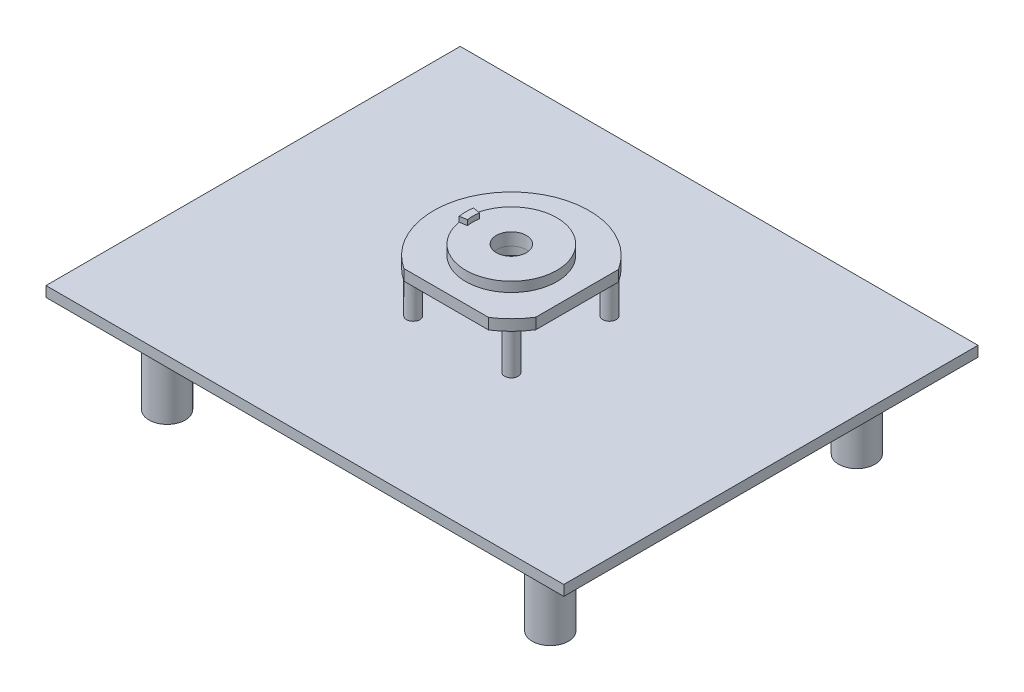
ISO-10303-21;
HEADER;
FILE_DESCRIPTION(('STEP AP214'),'2;1');
FILE_NAME('part.step','',(''),(''),'','','');
FILE_SCHEMA(('AUTOMOTIVE_DESIGN { 1 0 10303 214 1 1 1 1 }'));
ENDSEC;
DATA;
#1=APPLICATION_CONTEXT('core data for automotive mechanical design processes');
#2=APPLICATION_PROTOCOL_DEFINITION('international standard','automotive_design',2000,#1);
#3=PRODUCT_CONTEXT('',#1,'mechanical');
#4=PRODUCT('Part','Part','',(#3));
#5=PRODUCT_RELATED_PRODUCT_CATEGORY('part','',(#4));
#6=PRODUCT_DEFINITION_FORMATION('','',#4);
#7=PRODUCT_DEFINITION_CONTEXT('part definition',#1,'design');
#8=PRODUCT_DEFINITION('design','',#6,#7);
#9=PRODUCT_DEFINITION_SHAPE('','',#8);
#10=(LENGTH_UNIT() NAMED_UNIT(*) SI_UNIT(.MILLI.,.METRE.));
#11=(NAMED_UNIT(*) PLANE_ANGLE_UNIT() SI_UNIT($,.RADIAN.));
#12=(NAMED_UNIT(*) SI_UNIT($,.STERADIAN.) SOLID_ANGLE_UNIT());
#13=UNCERTAINTY_MEASURE_WITH_UNIT(LENGTH_MEASURE(1.E-05),#10,'distance_accuracy_value','');
#14=(GEOMETRIC_REPRESENTATION_CONTEXT(3) GLOBAL_UNCERTAINTY_ASSIGNED_CONTEXT((#13)) GLOBAL_UNIT_ASSIGNED_CONTEXT((#10,
#11,#12)) REPRESENTATION_CONTEXT('',''));
#15=CARTESIAN_POINT('',(0.,0.,0.));
#16=DIRECTION('',(0.,0.,1.));
#17=DIRECTION('',(1.,0.,0.));
#18=AXIS2_PLACEMENT_3D('',#15,#16,#17);
#19=CARTESIAN_POINT('',(0.,50.,0.623845660501408));
#20=DIRECTION('',(0.,1.,0.));
#21=DIRECTION('',(-1.,0.,0.));
#22=AXIS2_PLACEMENT_3D('',#19,#20,#21);
#23=CYLINDRICAL_SURFACE('',#22,75.);
#24=CARTESIAN_POINT('',(0.,50.,0.623845660501408));
#25=DIRECTION('',(0.,-1.,0.));
#26=DIRECTION('',(1.,0.,0.));
#27=AXIS2_PLACEMENT_3D('',#24,#25,#26);
#28=CIRCLE('',#27,75.);
#29=CARTESIAN_POINT('',(63.5,50.,40.5331177661161));
#30=VERTEX_POINT('',#29);
#31=CARTESIAN_POINT('',(40.8850732599998,50.,63.5));
#32=VERTEX_POINT('',#31);
#33=EDGE_CURVE('E291',#30,#32,#28,.T.);
#34=ORIENTED_EDGE('',*,*,#33,.F.);
#35=DIRECTION('',(0.,1.,0.));
#36=VECTOR('',#35,1.);
#37=CARTESIAN_POINT('',(63.5,50.,40.5331177661161));
#38=LINE('',#37,#36);
#39=CARTESIAN_POINT('',(63.5,60.54,40.5331177661161));
#40=VERTEX_POINT('',#39);
#41=EDGE_CURVE('E55',#30,#40,#38,.T.);
#42=ORIENTED_EDGE('',*,*,#41,.T.);
#43=CARTESIAN_POINT('',(0.,60.54,0.623845660501409));
#44=DIRECTION('',(0.,-1.,0.));
#45=DIRECTION('',(0.,0.,-1.));
#46=AXIS2_PLACEMENT_3D('',#43,#44,#45);
#47=CIRCLE('',#46,75.);
#48=CARTESIAN_POINT('',(40.8850732599998,60.54,63.5));
#49=VERTEX_POINT('',#48);
#50=EDGE_CURVE('E261',#40,#49,#47,.T.);
#51=ORIENTED_EDGE('',*,*,#50,.T.);
#52=DIRECTION('',(0.,1.,0.));
#53=VECTOR('',#52,1.);
#54=CARTESIAN_POINT('',(40.8850732599998,50.,63.5));
#55=LINE('',#54,#53);
#56=EDGE_CURVE('E266',#49,#32,#55,.F.);
#57=ORIENTED_EDGE('',*,*,#56,.T.);
#58=EDGE_LOOP('',(#34,#42,#51,#57));
#59=FACE_BOUND('',#58,.T.);
#60=ADVANCED_FACE('F37',(#59),#23,.T.);
#61=CARTESIAN_POINT('',(14.5,58.,0.623845660501408));
#62=DIRECTION('',(0.,-1.,0.));
#63=DIRECTION('',(0.,0.,-1.));
#64=AXIS2_PLACEMENT_3D('',#61,#62,#63);
#65=PLANE('',#64);
#66=CARTESIAN_POINT('',(0.,58.,0.623845660501408));
#67=DIRECTION('',(0.,-1.,0.));
#68=DIRECTION('',(0.,0.,-1.));
#69=AXIS2_PLACEMENT_3D('',#66,#67,#68);
#70=CIRCLE('',#69,14.5);
#71=CARTESIAN_POINT('',(0.,58.,-13.8761543394986));
#72=VERTEX_POINT('',#71);
#73=EDGE_CURVE('E157',#72,#72,#70,.T.);
#74=ORIENTED_EDGE('',*,*,#73,.F.);
#75=EDGE_LOOP('',(#74));
#76=FACE_BOUND('',#75,.T.);
#77=CARTESIAN_POINT('',(0.,58.,0.623845660501408));
#78=DIRECTION('',(0.,1.,0.));
#79=DIRECTION('',(-1.,0.,0.));
#80=AXIS2_PLACEMENT_3D('',#77,#78,#79);
#81=CIRCLE('',#80,15.);
#82=CARTESIAN_POINT('',(-15.,58.,0.623845660501408));
#83=VERTEX_POINT('',#82);
#84=EDGE_CURVE('E178',#83,#83,#81,.T.);
#85=ORIENTED_EDGE('',*,*,#84,.F.);
#86=EDGE_LOOP('',(#85));
#87=FACE_BOUND('',#86,.T.);
#88=ADVANCED_FACE('F353',(#76,#87),#65,.T.);
#89=CARTESIAN_POINT('',(0.,58.,0.623845660501408));
#90=DIRECTION('',(0.,-1.,0.));
#91=DIRECTION('',(0.,0.,-1.));
#92=AXIS2_PLACEMENT_3D('',#89,#90,#91);
#93=CYLINDRICAL_SURFACE('',#92,44.);
#94=CARTESIAN_POINT('',(0.,70.,0.623845660501408));
#95=DIRECTION('',(0.,-1.,0.));
#96=DIRECTION('',(0.,0.,-1.));
#97=AXIS2_PLACEMENT_3D('',#94,#95,#96);
#98=CIRCLE('',#97,44.);
#99=CARTESIAN_POINT('',(-43.458286986186,70.,-6.25927080126876));
#100=VERTEX_POINT('',#99);
#101=CARTESIAN_POINT('',(-43.458286986186,70.,7.50696212227159));
#102=VERTEX_POINT('',#101);
#103=EDGE_CURVE('E137',#100,#102,#98,.T.);
#104=ORIENTED_EDGE('',*,*,#103,.T.);
#105=DIRECTION('',(0.,-1.,0.));
#106=VECTOR('',#105,1.);
#107=CARTESIAN_POINT('',(-43.458286986186,75.,7.50696212227159));
#108=LINE('',#107,#106);
#109=CARTESIAN_POINT('',(-43.458286986186,75.,7.50696212227159));
#110=VERTEX_POINT('',#109);
#111=EDGE_CURVE('E127',#110,#102,#108,.T.);
#112=ORIENTED_EDGE('',*,*,#111,.F.);
#113=CARTESIAN_POINT('',(0.,75.,0.623845660501408));
#114=DIRECTION('',(0.,1.,0.));
#115=DIRECTION('',(0.,0.,1.));
#116=AXIS2_PLACEMENT_3D('',#113,#114,#115);
#117=CIRCLE('',#116,44.);
#118=CARTESIAN_POINT('',(-43.458286986186,75.,-6.25927080126876));
#119=VERTEX_POINT('',#118);
#120=EDGE_CURVE('E236',#119,#110,#117,.T.);
#121=ORIENTED_EDGE('',*,*,#120,.F.);
#122=DIRECTION('',(0.,-1.,0.));
#123=VECTOR('',#122,1.);
#124=CARTESIAN_POINT('',(-43.458286986186,75.,-6.25927080126876));
#125=LINE('',#124,#123);
#126=EDGE_CURVE('E153',#119,#100,#125,.T.);
#127=ORIENTED_EDGE('',*,*,#126,.T.);
#128=EDGE_LOOP('',(#104,#112,#121,#127));
#129=FACE_BOUND('',#128,.T.);
#130=CARTESIAN_POINT('',(0.,60.54,0.623845660501408));
#131=DIRECTION('',(0.,-1.,0.));
#132=DIRECTION('',(0.,0.,-1.));
#133=AXIS2_PLACEMENT_3D('',#130,#131,#132);
#134=CIRCLE('',#133,44.);
#135=CARTESIAN_POINT('',(0.,60.54,-43.3761543394986));
#136=VERTEX_POINT('',#135);
#137=EDGE_CURVE('E174',#136,#136,#134,.T.);
#138=ORIENTED_EDGE('',*,*,#137,.F.);
#139=EDGE_LOOP('',(#138));
#140=FACE_BOUND('',#139,.T.);
#141=ADVANCED_FACE('F150',(#129,#140),#93,.T.);
#142=CARTESIAN_POINT('',(0.,58.,0.623845660501408));
#143=DIRECTION('',(0.,-1.,0.));
#144=DIRECTION('',(0.,0.,-1.));
#145=AXIS2_PLACEMENT_3D('',#142,#143,#144);
#146=CYLINDRICAL_SURFACE('',#145,14.5);
#147=ORIENTED_EDGE('',*,*,#73,.T.);
#148=EDGE_LOOP('',(#147));
#149=FACE_BOUND('',#148,.T.);
#150=CARTESIAN_POINT('',(0.,70.,0.623845660501408));
#151=DIRECTION('',(0.,-1.,0.));
#152=DIRECTION('',(0.,0.,-1.));
#153=AXIS2_PLACEMENT_3D('',#150,#151,#152);
#154=CIRCLE('',#153,14.5);
#155=CARTESIAN_POINT('',(0.,70.,-13.8761543394986));
#156=VERTEX_POINT('',#155);
#157=EDGE_CURVE('E154',#156,#156,#154,.T.);
#158=ORIENTED_EDGE('',*,*,#157,.F.);
#159=EDGE_LOOP('',(#158));
#160=FACE_BOUND('',#159,.T.);
#161=ADVANCED_FACE('F414',(#149,#160),#146,.F.);
#162=CARTESIAN_POINT('',(14.5,70.,0.623845660501408));
#163=DIRECTION('',(0.,1.,0.));
#164=DIRECTION('',(0.,0.,1.));
#165=AXIS2_PLACEMENT_3D('',#162,#163,#164);
#166=PLANE('',#165);
#167=DIRECTION('',(-0.987688340595138,0.,-0.156434465040231));
#168=VECTOR('',#167,1.);
#169=CARTESIAN_POINT('',(0.,70.,0.623845660501408));
#170=LINE('',#169,#168);
#171=CARTESIAN_POINT('',(-36.5444686020201,70.,-5.16422954598714));
#172=VERTEX_POINT('',#171);
#173=EDGE_CURVE('E170',#172,#100,#170,.T.);
#174=ORIENTED_EDGE('',*,*,#173,.F.);
#175=CARTESIAN_POINT('',(0.,70.,0.623845660501408));
#176=DIRECTION('',(0.,1.,0.));
#177=DIRECTION('',(0.,0.,1.));
#178=AXIS2_PLACEMENT_3D('',#175,#176,#177);
#179=CIRCLE('',#178,37.);
#180=CARTESIAN_POINT('',(-36.5444686020201,70.,6.41192086698997));
#181=VERTEX_POINT('',#180);
#182=EDGE_CURVE('E146',#172,#181,#179,.T.);
#183=ORIENTED_EDGE('',*,*,#182,.T.);
#184=DIRECTION('',(-0.987688340595138,0.,0.156434465040232));
#185=VECTOR('',#184,1.);
#186=CARTESIAN_POINT('',(0.,70.,0.623845660501408));
#187=LINE('',#186,#185);
#188=EDGE_CURVE('E130',#181,#102,#187,.T.);
#189=ORIENTED_EDGE('',*,*,#188,.T.);
#190=ORIENTED_EDGE('',*,*,#103,.F.);
#191=EDGE_LOOP('',(#174,#183,#189,#190));
#192=FACE_BOUND('',#191,.T.);
#193=ORIENTED_EDGE('',*,*,#157,.T.);
#194=EDGE_LOOP('',(#193));
#195=FACE_BOUND('',#194,.T.);
#196=ADVANCED_FACE('F143',(#192,#195),#166,.T.);
#197=CARTESIAN_POINT('',(0.,75.,0.623845660501408));
#198=DIRECTION('',(0.156434465040232,0.,0.987688340595138));
#199=DIRECTION('',(0.987688340595138,0.,-0.156434465040232));
#200=AXIS2_PLACEMENT_3D('',#197,#198,#199);
#201=PLANE('',#200);
#202=ORIENTED_EDGE('',*,*,#188,.F.);
#203=DIRECTION('',(0.,-1.,0.));
#204=VECTOR('',#203,1.);
#205=CARTESIAN_POINT('',(-36.5444686020201,75.,6.41192086698997));
#206=LINE('',#205,#204);
#207=CARTESIAN_POINT('',(-36.5444686020201,75.,6.41192086698997));
#208=VERTEX_POINT('',#207);
#209=EDGE_CURVE('E138',#208,#181,#206,.T.);
#210=ORIENTED_EDGE('',*,*,#209,.F.);
#211=DIRECTION('',(-0.987688340595138,0.,0.156434465040232));
#212=VECTOR('',#211,1.);
#213=CARTESIAN_POINT('',(0.,75.,0.623845660501408));
#214=LINE('',#213,#212);
#215=EDGE_CURVE('E133',#208,#110,#214,.T.);
#216=ORIENTED_EDGE('',*,*,#215,.T.);
#217=ORIENTED_EDGE('',*,*,#111,.T.);
#218=EDGE_LOOP('',(#202,#210,#216,#217));
#219=FACE_BOUND('',#218,.T.);
#220=ADVANCED_FACE('F129',(#219),#201,.T.);
#221=CARTESIAN_POINT('',(0.,75.,0.623845660501408));
#222=DIRECTION('',(0.,-1.,0.));
#223=DIRECTION('',(0.,0.,-1.));
#224=AXIS2_PLACEMENT_3D('',#221,#222,#223);
#225=CYLINDRICAL_SURFACE('',#224,37.);
#226=ORIENTED_EDGE('',*,*,#182,.F.);
#227=DIRECTION('',(0.,-1.,0.));
#228=VECTOR('',#227,1.);
#229=CARTESIAN_POINT('',(-36.5444686020201,75.,-5.16422954598714));
#230=LINE('',#229,#228);
#231=CARTESIAN_POINT('',(-36.5444686020201,75.,-5.16422954598714));
#232=VERTEX_POINT('',#231);
#233=EDGE_CURVE('E171',#232,#172,#230,.T.);
#234=ORIENTED_EDGE('',*,*,#233,.F.);
#235=CARTESIAN_POINT('',(0.,75.,0.623845660501408));
#236=DIRECTION('',(0.,1.,0.));
#237=DIRECTION('',(0.,0.,1.));
#238=AXIS2_PLACEMENT_3D('',#235,#236,#237);
#239=CIRCLE('',#238,37.);
#240=EDGE_CURVE('E238',#232,#208,#239,.T.);
#241=ORIENTED_EDGE('',*,*,#240,.T.);
#242=ORIENTED_EDGE('',*,*,#209,.T.);
#243=EDGE_LOOP('',(#226,#234,#241,#242));
#244=FACE_BOUND('',#243,.T.);
#245=ADVANCED_FACE('F422',(#244),#225,.F.);
#246=CARTESIAN_POINT('',(0.,75.,0.623845660501408));
#247=DIRECTION('',(-0.156434465040231,0.,0.987688340595138));
#248=DIRECTION('',(0.987688340595138,0.,0.156434465040231));
#249=AXIS2_PLACEMENT_3D('',#246,#247,#248);
#250=PLANE('',#249);
#251=ORIENTED_EDGE('',*,*,#173,.T.);
#252=ORIENTED_EDGE('',*,*,#126,.F.);
#253=DIRECTION('',(-0.987688340595138,0.,-0.156434465040231));
#254=VECTOR('',#253,1.);
#255=CARTESIAN_POINT('',(0.,75.,0.623845660501408));
#256=LINE('',#255,#254);
#257=EDGE_CURVE('E167',#232,#119,#256,.T.);
#258=ORIENTED_EDGE('',*,*,#257,.F.);
#259=ORIENTED_EDGE('',*,*,#233,.T.);
#260=EDGE_LOOP('',(#251,#252,#258,#259));
#261=FACE_BOUND('',#260,.T.);
#262=ADVANCED_FACE('F425',(#261),#250,.F.);
#263=CARTESIAN_POINT('',(0.,75.,0.623845660501408));
#264=DIRECTION('',(0.,1.,0.));
#265=DIRECTION('',(0.,0.,1.));
#266=AXIS2_PLACEMENT_3D('',#263,#264,#265);
#267=PLANE('',#266);
#268=ORIENTED_EDGE('',*,*,#120,.T.);
#269=ORIENTED_EDGE('',*,*,#215,.F.);
#270=ORIENTED_EDGE('',*,*,#240,.F.);
#271=ORIENTED_EDGE('',*,*,#257,.T.);
#272=EDGE_LOOP('',(#268,#269,#270,#271));
#273=FACE_BOUND('',#272,.T.);
#274=ADVANCED_FACE('F408',(#273),#267,.T.);
#275=CARTESIAN_POINT('',(0.,60.54,0.623845660501408));
#276=DIRECTION('',(0.,-1.,0.));
#277=DIRECTION('',(1.,0.,0.));
#278=AXIS2_PLACEMENT_3D('',#275,#276,#277);
#279=PLANE('',#278);
#280=ORIENTED_EDGE('',*,*,#50,.F.);
#281=DIRECTION('',(0.,0.,1.));
#282=VECTOR('',#281,1.);
#283=CARTESIAN_POINT('',(63.5,60.54,-50.8));
#284=LINE('',#283,#282);
#285=CARTESIAN_POINT('',(63.5,60.54,-39.2854264451133));
#286=VERTEX_POINT('',#285);
#287=EDGE_CURVE('E186',#286,#40,#284,.T.);
#288=ORIENTED_EDGE('',*,*,#287,.F.);
#289=CARTESIAN_POINT('',(0.,60.54,0.623845660501409));
#290=DIRECTION('',(0.,-1.,0.));
#291=DIRECTION('',(0.,0.,-1.));
#292=AXIS2_PLACEMENT_3D('',#289,#290,#291);
#293=CIRCLE('',#292,75.);
#294=CARTESIAN_POINT('',(-40.8850732599998,60.54,63.5));
#295=VERTEX_POINT('',#294);
#296=EDGE_CURVE('E263',#295,#286,#293,.T.);
#297=ORIENTED_EDGE('',*,*,#296,.F.);
#298=DIRECTION('',(-1.,0.,0.));
#299=VECTOR('',#298,1.);
#300=CARTESIAN_POINT('',(-50.8,60.54,63.5));
#301=LINE('',#300,#299);
#302=EDGE_CURVE('E265',#49,#295,#301,.T.);
#303=ORIENTED_EDGE('',*,*,#302,.F.);
#304=EDGE_LOOP('',(#280,#288,#297,#303));
#305=FACE_BOUND('',#304,.T.);
#306=ORIENTED_EDGE('',*,*,#137,.T.);
#307=EDGE_LOOP('',(#306));
#308=FACE_BOUND('',#307,.T.);
#309=ADVANCED_FACE('F328',(#305,#308),#279,.F.);
#310=CARTESIAN_POINT('',(0.,0.,0.));
#311=DIRECTION('',(0.,-1.,0.));
#312=DIRECTION('',(0.,0.,-1.));
#313=AXIS2_PLACEMENT_3D('',#310,#311,#312);
#314=PLANE('',#313);
#315=CARTESIAN_POINT('',(0.,0.,0.6238494));
#316=DIRECTION('',(0.,-1.,0.));
#317=DIRECTION('',(0.,0.,-1.));
#318=AXIS2_PLACEMENT_3D('',#315,#316,#317);
#319=CIRCLE('',#318,10.);
#320=CARTESIAN_POINT('',(0.,0.,-9.3761506));
#321=VERTEX_POINT('',#320);
#322=EDGE_CURVE('E253',#321,#321,#319,.T.);
#323=ORIENTED_EDGE('',*,*,#322,.F.);
#324=EDGE_LOOP('',(#323));
#325=FACE_BOUND('',#324,.T.);
#326=CARTESIAN_POINT('',(-185.,0.,148.));
#327=DIRECTION('',(0.,-1.,0.));
#328=DIRECTION('',(0.,0.,-1.));
#329=AXIS2_PLACEMENT_3D('',#326,#327,#328);
#330=CIRCLE('',#329,17.5);
#331=CARTESIAN_POINT('',(-185.,0.,130.5));
#332=VERTEX_POINT('',#331);
#333=EDGE_CURVE('E147',#332,#332,#330,.T.);
#334=ORIENTED_EDGE('',*,*,#333,.F.);
#335=EDGE_LOOP('',(#334));
#336=FACE_BOUND('',#335,.T.);
#337=CARTESIAN_POINT('',(-185.,0.,-148.));
#338=DIRECTION('',(0.,-1.,0.));
#339=DIRECTION('',(0.,0.,-1.));
#340=AXIS2_PLACEMENT_3D('',#337,#338,#339);
#341=CIRCLE('',#340,17.5);
#342=CARTESIAN_POINT('',(-185.,0.,-165.5));
#343=VERTEX_POINT('',#342);
#344=EDGE_CURVE('E192',#343,#343,#341,.T.);
#345=ORIENTED_EDGE('',*,*,#344,.F.);
#346=EDGE_LOOP('',(#345));
#347=FACE_BOUND('',#346,.T.);
#348=DIRECTION('',(0.,0.,1.));
#349=VECTOR('',#348,1.);
#350=CARTESIAN_POINT('',(-250.,0.,-200.));
#351=LINE('',#350,#349);
#352=CARTESIAN_POINT('',(-250.,0.,-200.));
#353=VERTEX_POINT('',#352);
#354=CARTESIAN_POINT('',(-250.,0.,200.));
#355=VERTEX_POINT('',#354);
#356=EDGE_CURVE('E191',#353,#355,#351,.T.);
#357=ORIENTED_EDGE('',*,*,#356,.F.);
#358=DIRECTION('',(-1.,0.,0.));
#359=VECTOR('',#358,1.);
#360=CARTESIAN_POINT('',(250.,0.,-200.));
#361=LINE('',#360,#359);
#362=CARTESIAN_POINT('',(250.,0.,-200.));
#363=VERTEX_POINT('',#362);
#364=EDGE_CURVE('E217',#363,#353,#361,.T.);
#365=ORIENTED_EDGE('',*,*,#364,.F.);
#366=DIRECTION('',(0.,0.,-1.));
#367=VECTOR('',#366,1.);
#368=CARTESIAN_POINT('',(250.,0.,-200.));
#369=LINE('',#368,#367);
#370=CARTESIAN_POINT('',(250.,0.,200.));
#371=VERTEX_POINT('',#370);
#372=EDGE_CURVE('E215',#371,#363,#369,.T.);
#373=ORIENTED_EDGE('',*,*,#372,.F.);
#374=DIRECTION('',(1.,0.,0.));
#375=VECTOR('',#374,1.);
#376=CARTESIAN_POINT('',(250.,0.,200.));
#377=LINE('',#376,#375);
#378=EDGE_CURVE('E213',#355,#371,#377,.T.);
#379=ORIENTED_EDGE('',*,*,#378,.F.);
#380=EDGE_LOOP('',(#357,#365,#373,#379));
#381=FACE_BOUND('',#380,.T.);
#382=CARTESIAN_POINT('',(185.,0.,-148.));
#383=DIRECTION('',(0.,-1.,0.));
#384=DIRECTION('',(0.,0.,-1.));
#385=AXIS2_PLACEMENT_3D('',#382,#383,#384);
#386=CIRCLE('',#385,17.5);
#387=CARTESIAN_POINT('',(185.,0.,-165.5));
#388=VERTEX_POINT('',#387);
#389=EDGE_CURVE('E231',#388,#388,#386,.T.);
#390=ORIENTED_EDGE('',*,*,#389,.F.);
#391=EDGE_LOOP('',(#390));
#392=FACE_BOUND('',#391,.T.);
#393=CARTESIAN_POINT('',(185.,0.,148.));
#394=DIRECTION('',(0.,-1.,0.));
#395=DIRECTION('',(0.,0.,1.));
#396=AXIS2_PLACEMENT_3D('',#393,#394,#395);
#397=CIRCLE('',#396,17.5);
#398=CARTESIAN_POINT('',(185.,0.,165.5));
#399=VERTEX_POINT('',#398);
#400=EDGE_CURVE('E195',#399,#399,#397,.T.);
#401=ORIENTED_EDGE('',*,*,#400,.F.);
#402=EDGE_LOOP('',(#401));
#403=FACE_BOUND('',#402,.T.);
#404=ADVANCED_FACE('F325',(#325,#336,#347,#381,#392,#403),#314,.T.);
#405=CARTESIAN_POINT('',(-250.,4.,-200.));
#406=DIRECTION('',(1.,0.,0.));
#407=DIRECTION('',(0.,0.,-1.));
#408=AXIS2_PLACEMENT_3D('',#405,#406,#407);
#409=PLANE('',#408);
#410=ORIENTED_EDGE('',*,*,#356,.T.);
#411=DIRECTION('',(0.,-1.,0.));
#412=VECTOR('',#411,1.);
#413=CARTESIAN_POINT('',(-250.,4.,200.));
#414=LINE('',#413,#412);
#415=CARTESIAN_POINT('',(-250.,10.,200.));
#416=VERTEX_POINT('',#415);
#417=EDGE_CURVE('E228',#416,#355,#414,.T.);
#418=ORIENTED_EDGE('',*,*,#417,.F.);
#419=DIRECTION('',(0.,0.,1.));
#420=VECTOR('',#419,1.);
#421=CARTESIAN_POINT('',(-250.,10.,-200.));
#422=LINE('',#421,#420);
#423=CARTESIAN_POINT('',(-250.,10.,-200.));
#424=VERTEX_POINT('',#423);
#425=EDGE_CURVE('E302',#424,#416,#422,.T.);
#426=ORIENTED_EDGE('',*,*,#425,.F.);
#427=DIRECTION('',(0.,-1.,0.));
#428=VECTOR('',#427,1.);
#429=CARTESIAN_POINT('',(-250.,4.,-200.));
#430=LINE('',#429,#428);
#431=EDGE_CURVE('E219',#424,#353,#430,.T.);
#432=ORIENTED_EDGE('',*,*,#431,.T.);
#433=EDGE_LOOP('',(#410,#418,#426,#432));
#434=FACE_BOUND('',#433,.T.);
#435=ADVANCED_FACE('F319',(#434),#409,.F.);
#436=CARTESIAN_POINT('',(250.,4.,200.));
#437=DIRECTION('',(0.,0.,-1.));
#438=DIRECTION('',(-1.,0.,0.));
#439=AXIS2_PLACEMENT_3D('',#436,#437,#438);
#440=PLANE('',#439);
#441=ORIENTED_EDGE('',*,*,#378,.T.);
#442=DIRECTION('',(0.,-1.,0.));
#443=VECTOR('',#442,1.);
#444=CARTESIAN_POINT('',(250.,4.,200.));
#445=LINE('',#444,#443);
#446=CARTESIAN_POINT('',(250.,10.,200.));
#447=VERTEX_POINT('',#446);
#448=EDGE_CURVE('E225',#447,#371,#445,.T.);
#449=ORIENTED_EDGE('',*,*,#448,.F.);
#450=DIRECTION('',(1.,0.,0.));
#451=VECTOR('',#450,1.);
#452=CARTESIAN_POINT('',(-250.,10.,200.));
#453=LINE('',#452,#451);
#454=EDGE_CURVE('E304',#416,#447,#453,.T.);
#455=ORIENTED_EDGE('',*,*,#454,.F.);
#456=ORIENTED_EDGE('',*,*,#417,.T.);
#457=EDGE_LOOP('',(#441,#449,#455,#456));
#458=FACE_BOUND('',#457,.T.);
#459=ADVANCED_FACE('F321',(#458),#440,.F.);
#460=CARTESIAN_POINT('',(250.,4.,-200.));
#461=DIRECTION('',(-1.,0.,0.));
#462=DIRECTION('',(0.,0.,1.));
#463=AXIS2_PLACEMENT_3D('',#460,#461,#462);
#464=PLANE('',#463);
#465=ORIENTED_EDGE('',*,*,#372,.T.);
#466=DIRECTION('',(0.,-1.,0.));
#467=VECTOR('',#466,1.);
#468=CARTESIAN_POINT('',(250.,4.,-200.));
#469=LINE('',#468,#467);
#470=CARTESIAN_POINT('',(250.,10.,-200.));
#471=VERTEX_POINT('',#470);
#472=EDGE_CURVE('E222',#471,#363,#469,.T.);
#473=ORIENTED_EDGE('',*,*,#472,.F.);
#474=DIRECTION('',(0.,0.,-1.));
#475=VECTOR('',#474,1.);
#476=CARTESIAN_POINT('',(250.,10.,200.));
#477=LINE('',#476,#475);
#478=EDGE_CURVE('E196',#447,#471,#477,.T.);
#479=ORIENTED_EDGE('',*,*,#478,.F.);
#480=ORIENTED_EDGE('',*,*,#448,.T.);
#481=EDGE_LOOP('',(#465,#473,#479,#480));
#482=FACE_BOUND('',#481,.T.);
#483=ADVANCED_FACE('F323',(#482),#464,.F.);
#484=CARTESIAN_POINT('',(250.,4.,-200.));
#485=DIRECTION('',(0.,0.,1.));
#486=DIRECTION('',(1.,0.,0.));
#487=AXIS2_PLACEMENT_3D('',#484,#485,#486);
#488=PLANE('',#487);
#489=ORIENTED_EDGE('',*,*,#364,.T.);
#490=ORIENTED_EDGE('',*,*,#431,.F.);
#491=DIRECTION('',(-1.,0.,0.));
#492=VECTOR('',#491,1.);
#493=CARTESIAN_POINT('',(250.,10.,-200.));
#494=LINE('',#493,#492);
#495=EDGE_CURVE('E256',#471,#424,#494,.T.);
#496=ORIENTED_EDGE('',*,*,#495,.F.);
#497=ORIENTED_EDGE('',*,*,#472,.T.);
#498=EDGE_LOOP('',(#489,#490,#496,#497));
#499=FACE_BOUND('',#498,.T.);
#500=ADVANCED_FACE('F314',(#499),#488,.F.);
#501=CARTESIAN_POINT('',(-185.,-100.,-148.));
#502=DIRECTION('',(0.,1.,0.));
#503=DIRECTION('',(0.,0.,1.));
#504=AXIS2_PLACEMENT_3D('',#501,#502,#503);
#505=CYLINDRICAL_SURFACE('',#504,17.5);
#506=CARTESIAN_POINT('',(-185.,-87.3,-148.));
#507=DIRECTION('',(0.,-1.,0.));
#508=DIRECTION('',(0.,0.,-1.));
#509=AXIS2_PLACEMENT_3D('',#506,#507,#508);
#510=CIRCLE('',#509,17.5);
#511=CARTESIAN_POINT('',(-185.,-87.3,-165.5));
#512=VERTEX_POINT('',#511);
#513=EDGE_CURVE('E188',#512,#512,#510,.T.);
#514=ORIENTED_EDGE('',*,*,#513,.F.);
#515=EDGE_LOOP('',(#514));
#516=FACE_BOUND('',#515,.T.);
#517=ORIENTED_EDGE('',*,*,#344,.T.);
#518=EDGE_LOOP('',(#517));
#519=FACE_BOUND('',#518,.T.);
#520=ADVANCED_FACE('F347',(#516,#519),#505,.T.);
#521=CARTESIAN_POINT('',(-185.,-87.3,-148.));
#522=DIRECTION('',(0.,-1.,0.));
#523=DIRECTION('',(0.,0.,-1.));
#524=AXIS2_PLACEMENT_3D('',#521,#522,#523);
#525=PLANE('',#524);
#526=ORIENTED_EDGE('',*,*,#513,.T.);
#527=EDGE_LOOP('',(#526));
#528=FACE_BOUND('',#527,.T.);
#529=ADVANCED_FACE('F337',(#528),#525,.T.);
#530=CARTESIAN_POINT('',(185.,-100.,-148.));
#531=DIRECTION('',(0.,1.,0.));
#532=DIRECTION('',(0.,0.,1.));
#533=AXIS2_PLACEMENT_3D('',#530,#531,#532);
#534=CYLINDRICAL_SURFACE('',#533,17.5);
#535=CARTESIAN_POINT('',(185.,-87.3,-148.));
#536=DIRECTION('',(0.,-1.,0.));
#537=DIRECTION('',(0.,0.,-1.));
#538=AXIS2_PLACEMENT_3D('',#535,#536,#537);
#539=CIRCLE('',#538,17.5);
#540=CARTESIAN_POINT('',(185.,-87.3,-165.5));
#541=VERTEX_POINT('',#540);
#542=EDGE_CURVE('E41',#541,#541,#539,.F.);
#543=ORIENTED_EDGE('',*,*,#542,.T.);
#544=EDGE_LOOP('',(#543));
#545=FACE_BOUND('',#544,.T.);
#546=ORIENTED_EDGE('',*,*,#389,.T.);
#547=EDGE_LOOP('',(#546));
#548=FACE_BOUND('',#547,.T.);
#549=ADVANCED_FACE('F334',(#545,#548),#534,.T.);
#550=CARTESIAN_POINT('',(185.,-87.3,-148.));
#551=DIRECTION('',(0.,-1.,0.));
#552=DIRECTION('',(0.,0.,-1.));
#553=AXIS2_PLACEMENT_3D('',#550,#551,#552);
#554=PLANE('',#553);
#555=ORIENTED_EDGE('',*,*,#542,.F.);
#556=EDGE_LOOP('',(#555));
#557=FACE_BOUND('',#556,.T.);
#558=ADVANCED_FACE('F336',(#557),#554,.T.);
#559=CARTESIAN_POINT('',(185.,-100.,148.));
#560=DIRECTION('',(0.,1.,0.));
#561=DIRECTION('',(0.,0.,1.));
#562=AXIS2_PLACEMENT_3D('',#559,#560,#561);
#563=CYLINDRICAL_SURFACE('',#562,17.5);
#564=CARTESIAN_POINT('',(185.,-87.3,148.));
#565=DIRECTION('',(0.,-1.,0.));
#566=DIRECTION('',(0.,0.,-1.));
#567=AXIS2_PLACEMENT_3D('',#564,#565,#566);
#568=CIRCLE('',#567,17.5);
#569=CARTESIAN_POINT('',(185.,-87.3,130.5));
#570=VERTEX_POINT('',#569);
#571=EDGE_CURVE('E197',#570,#570,#568,.T.);
#572=ORIENTED_EDGE('',*,*,#571,.F.);
#573=EDGE_LOOP('',(#572));
#574=FACE_BOUND('',#573,.T.);
#575=ORIENTED_EDGE('',*,*,#400,.T.);
#576=EDGE_LOOP('',(#575));
#577=FACE_BOUND('',#576,.T.);
#578=ADVANCED_FACE('F344',(#574,#577),#563,.T.);
#579=CARTESIAN_POINT('',(185.,-87.3,148.));
#580=DIRECTION('',(0.,-1.,0.));
#581=DIRECTION('',(0.,0.,1.));
#582=AXIS2_PLACEMENT_3D('',#579,#580,#581);
#583=PLANE('',#582);
#584=ORIENTED_EDGE('',*,*,#571,.T.);
#585=EDGE_LOOP('',(#584));
#586=FACE_BOUND('',#585,.T.);
#587=ADVANCED_FACE('F396',(#586),#583,.T.);
#588=CARTESIAN_POINT('',(-185.,-100.,148.));
#589=DIRECTION('',(0.,1.,0.));
#590=DIRECTION('',(0.,0.,1.));
#591=AXIS2_PLACEMENT_3D('',#588,#589,#590);
#592=CYLINDRICAL_SURFACE('',#591,17.5);
#593=CARTESIAN_POINT('',(-185.,-87.3,148.));
#594=DIRECTION('',(0.,-1.,0.));
#595=DIRECTION('',(0.,0.,-1.));
#596=AXIS2_PLACEMENT_3D('',#593,#594,#595);
#597=CIRCLE('',#596,17.5);
#598=CARTESIAN_POINT('',(-185.,-87.3,130.5));
#599=VERTEX_POINT('',#598);
#600=EDGE_CURVE('E193',#599,#599,#597,.F.);
#601=ORIENTED_EDGE('',*,*,#600,.T.);
#602=EDGE_LOOP('',(#601));
#603=FACE_BOUND('',#602,.T.);
#604=ORIENTED_EDGE('',*,*,#333,.T.);
#605=EDGE_LOOP('',(#604));
#606=FACE_BOUND('',#605,.T.);
#607=ADVANCED_FACE('F394',(#603,#606),#592,.T.);
#608=CARTESIAN_POINT('',(-185.,-87.3,148.));
#609=DIRECTION('',(0.,-1.,0.));
#610=DIRECTION('',(0.,0.,1.));
#611=AXIS2_PLACEMENT_3D('',#608,#609,#610);
#612=PLANE('',#611);
#613=ORIENTED_EDGE('',*,*,#600,.F.);
#614=EDGE_LOOP('',(#613));
#615=FACE_BOUND('',#614,.T.);
#616=ADVANCED_FACE('F39',(#615),#612,.T.);
#617=CARTESIAN_POINT('',(0.,10.,0.));
#618=DIRECTION('',(0.,1.,0.));
#619=DIRECTION('',(0.,0.,1.));
#620=AXIS2_PLACEMENT_3D('',#617,#618,#619);
#621=PLANE('',#620);
#622=CARTESIAN_POINT('',(47.3761543394981,10.,48.0000000000007));
#623=DIRECTION('',(0.,-1.,0.));
#624=DIRECTION('',(0.,0.,-1.));
#625=AXIS2_PLACEMENT_3D('',#622,#623,#624);
#626=CIRCLE('',#625,6.5);
#627=CARTESIAN_POINT('',(47.3761543394982,10.,41.5000000000007));
#628=VERTEX_POINT('',#627);
#629=EDGE_CURVE('E260',#628,#628,#626,.T.);
#630=ORIENTED_EDGE('',*,*,#629,.T.);
#631=EDGE_LOOP('',(#630));
#632=FACE_BOUND('',#631,.T.);
#633=CARTESIAN_POINT('',(47.3761543394988,10.,-46.7523086789972));
#634=DIRECTION('',(0.,-1.,0.));
#635=DIRECTION('',(-1.,0.,0.));
#636=AXIS2_PLACEMENT_3D('',#633,#634,#635);
#637=CIRCLE('',#636,6.5);
#638=CARTESIAN_POINT('',(40.8761543394988,10.,-46.7523086789972));
#639=VERTEX_POINT('',#638);
#640=EDGE_CURVE('E295',#639,#639,#637,.T.);
#641=ORIENTED_EDGE('',*,*,#640,.T.);
#642=EDGE_LOOP('',(#641));
#643=FACE_BOUND('',#642,.T.);
#644=CARTESIAN_POINT('',(-47.3761543394984,10.,-46.7523086789975));
#645=DIRECTION('',(0.,-1.,0.));
#646=DIRECTION('',(0.,0.,1.));
#647=AXIS2_PLACEMENT_3D('',#644,#645,#646);
#648=CIRCLE('',#647,6.5);
#649=CARTESIAN_POINT('',(-47.3761543394984,10.,-40.2523086789975));
#650=VERTEX_POINT('',#649);
#651=EDGE_CURVE('E287',#650,#650,#648,.T.);
#652=ORIENTED_EDGE('',*,*,#651,.T.);
#653=EDGE_LOOP('',(#652));
#654=FACE_BOUND('',#653,.T.);
#655=CARTESIAN_POINT('',(-47.3761543394988,10.,48.));
#656=DIRECTION('',(0.,-1.,0.));
#657=DIRECTION('',(1.,0.,0.));
#658=AXIS2_PLACEMENT_3D('',#655,#656,#657);
#659=CIRCLE('',#658,6.5);
#660=CARTESIAN_POINT('',(-40.8761543394988,10.,48.));
#661=VERTEX_POINT('',#660);
#662=EDGE_CURVE('E292',#661,#661,#659,.T.);
#663=ORIENTED_EDGE('',*,*,#662,.T.);
#664=EDGE_LOOP('',(#663));
#665=FACE_BOUND('',#664,.T.);
#666=CARTESIAN_POINT('',(0.,10.,0.623849400000001));
#667=DIRECTION('',(0.,1.,0.));
#668=DIRECTION('',(0.,0.,1.));
#669=AXIS2_PLACEMENT_3D('',#666,#667,#668);
#670=CIRCLE('',#669,10.);
#671=CARTESIAN_POINT('',(0.,10.,10.6238494));
#672=VERTEX_POINT('',#671);
#673=EDGE_CURVE('E257',#672,#672,#670,.T.);
#674=ORIENTED_EDGE('',*,*,#673,.F.);
#675=EDGE_LOOP('',(#674));
#676=FACE_BOUND('',#675,.T.);
#677=ORIENTED_EDGE('',*,*,#495,.T.);
#678=ORIENTED_EDGE('',*,*,#425,.T.);
#679=ORIENTED_EDGE('',*,*,#454,.T.);
#680=ORIENTED_EDGE('',*,*,#478,.T.);
#681=EDGE_LOOP('',(#677,#678,#679,#680));
#682=FACE_BOUND('',#681,.T.);
#683=ADVANCED_FACE('F311',(#632,#643,#654,#665,#676,#682),#621,.T.);
#684=CARTESIAN_POINT('',(0.,-100.,0.623849399999994));
#685=DIRECTION('',(0.,1.,0.));
#686=DIRECTION('',(0.,0.,1.));
#687=AXIS2_PLACEMENT_3D('',#684,#685,#686);
#688=CYLINDRICAL_SURFACE('',#687,10.);
#689=ORIENTED_EDGE('',*,*,#322,.T.);
#690=EDGE_LOOP('',(#689));
#691=FACE_BOUND('',#690,.T.);
#692=ORIENTED_EDGE('',*,*,#673,.T.);
#693=EDGE_LOOP('',(#692));
#694=FACE_BOUND('',#693,.T.);
#695=ADVANCED_FACE('F389',(#691,#694),#688,.F.);
#696=CARTESIAN_POINT('',(47.3761543394981,10.,48.0000000000007));
#697=DIRECTION('',(0.,1.,0.));
#698=DIRECTION('',(-1.,0.,0.));
#699=AXIS2_PLACEMENT_3D('',#696,#697,#698);
#700=CYLINDRICAL_SURFACE('',#699,6.5);
#701=ORIENTED_EDGE('',*,*,#629,.F.);
#702=EDGE_LOOP('',(#701));
#703=FACE_BOUND('',#702,.T.);
#704=CARTESIAN_POINT('',(47.3761543394981,50.,48.0000000000007));
#705=DIRECTION('',(0.,-1.,0.));
#706=DIRECTION('',(0.,0.,-1.));
#707=AXIS2_PLACEMENT_3D('',#704,#705,#706);
#708=CIRCLE('',#707,6.5);
#709=CARTESIAN_POINT('',(47.3761543394982,50.,41.5000000000007));
#710=VERTEX_POINT('',#709);
#711=EDGE_CURVE('E284',#710,#710,#708,.T.);
#712=ORIENTED_EDGE('',*,*,#711,.T.);
#713=EDGE_LOOP('',(#712));
#714=FACE_BOUND('',#713,.T.);
#715=ADVANCED_FACE('F380',(#703,#714),#700,.T.);
#716=CARTESIAN_POINT('',(47.3761543394988,10.,-46.7523086789972));
#717=DIRECTION('',(0.,1.,0.));
#718=DIRECTION('',(-1.,0.,0.));
#719=AXIS2_PLACEMENT_3D('',#716,#717,#718);
#720=CYLINDRICAL_SURFACE('',#719,6.5);
#721=ORIENTED_EDGE('',*,*,#640,.F.);
#722=EDGE_LOOP('',(#721));
#723=FACE_BOUND('',#722,.T.);
#724=CARTESIAN_POINT('',(47.3761543394988,50.,-46.7523086789972));
#725=DIRECTION('',(0.,-1.,0.));
#726=DIRECTION('',(-1.,0.,0.));
#727=AXIS2_PLACEMENT_3D('',#724,#725,#726);
#728=CIRCLE('',#727,6.5);
#729=CARTESIAN_POINT('',(40.8761543394988,50.,-46.7523086789972));
#730=VERTEX_POINT('',#729);
#731=EDGE_CURVE('E278',#730,#730,#728,.T.);
#732=ORIENTED_EDGE('',*,*,#731,.T.);
#733=EDGE_LOOP('',(#732));
#734=FACE_BOUND('',#733,.T.);
#735=ADVANCED_FACE('F374',(#723,#734),#720,.T.);
#736=CARTESIAN_POINT('',(-47.3761543394984,10.,-46.7523086789975));
#737=DIRECTION('',(0.,1.,0.));
#738=DIRECTION('',(-1.,0.,0.));
#739=AXIS2_PLACEMENT_3D('',#736,#737,#738);
#740=CYLINDRICAL_SURFACE('',#739,6.5);
#741=ORIENTED_EDGE('',*,*,#651,.F.);
#742=EDGE_LOOP('',(#741));
#743=FACE_BOUND('',#742,.T.);
#744=CARTESIAN_POINT('',(-47.3761543394984,50.,-46.7523086789975));
#745=DIRECTION('',(0.,-1.,0.));
#746=DIRECTION('',(0.,0.,1.));
#747=AXIS2_PLACEMENT_3D('',#744,#745,#746);
#748=CIRCLE('',#747,6.5);
#749=CARTESIAN_POINT('',(-47.3761543394984,50.,-40.2523086789975));
#750=VERTEX_POINT('',#749);
#751=EDGE_CURVE('E273',#750,#750,#748,.T.);
#752=ORIENTED_EDGE('',*,*,#751,.T.);
#753=EDGE_LOOP('',(#752));
#754=FACE_BOUND('',#753,.T.);
#755=ADVANCED_FACE('F367',(#743,#754),#740,.T.);
#756=ORIENTED_EDGE('',*,*,#296,.T.);
#757=DIRECTION('',(0.,1.,0.));
#758=VECTOR('',#757,1.);
#759=CARTESIAN_POINT('',(63.5,50.,-39.2854264451133));
#760=LINE('',#759,#758);
#761=CARTESIAN_POINT('',(63.5,50.,-39.2854264451133));
#762=VERTEX_POINT('',#761);
#763=EDGE_CURVE('E73',#286,#762,#760,.F.);
#764=ORIENTED_EDGE('',*,*,#763,.T.);
#765=CARTESIAN_POINT('',(-40.8850732599998,50.,63.5));
#766=VERTEX_POINT('',#765);
#767=EDGE_CURVE('E264',#766,#762,#28,.T.);
#768=ORIENTED_EDGE('',*,*,#767,.F.);
#769=DIRECTION('',(0.,1.,0.));
#770=VECTOR('',#769,1.);
#771=CARTESIAN_POINT('',(-40.8850732599998,50.,63.5));
#772=LINE('',#771,#770);
#773=EDGE_CURVE('E647',#766,#295,#772,.T.);
#774=ORIENTED_EDGE('',*,*,#773,.T.);
#775=EDGE_LOOP('',(#756,#764,#768,#774));
#776=FACE_BOUND('',#775,.T.);
#777=ADVANCED_FACE('F356',(#776),#23,.T.);
#778=CARTESIAN_POINT('',(0.,50.,0.623845660501408));
#779=DIRECTION('',(0.,-1.,0.));
#780=DIRECTION('',(1.,0.,0.));
#781=AXIS2_PLACEMENT_3D('',#778,#779,#780);
#782=PLANE('',#781);
#783=DIRECTION('',(0.,0.,-1.));
#784=VECTOR('',#783,1.);
#785=CARTESIAN_POINT('',(63.5,50.,0.623845660501408));
#786=LINE('',#785,#784);
#787=EDGE_CURVE('E12',#30,#762,#786,.T.);
#788=ORIENTED_EDGE('',*,*,#787,.F.);
#789=ORIENTED_EDGE('',*,*,#33,.T.);
#790=DIRECTION('',(1.,0.,0.));
#791=VECTOR('',#790,1.);
#792=CARTESIAN_POINT('',(0.,50.,63.5));
#793=LINE('',#792,#791);
#794=EDGE_CURVE('E47',#766,#32,#793,.T.);
#795=ORIENTED_EDGE('',*,*,#794,.F.);
#796=ORIENTED_EDGE('',*,*,#767,.T.);
#797=EDGE_LOOP('',(#788,#789,#795,#796));
#798=FACE_BOUND('',#797,.T.);
#799=CARTESIAN_POINT('',(0.,50.,0.623845660501408));
#800=DIRECTION('',(0.,-1.,0.));
#801=DIRECTION('',(1.,0.,0.));
#802=AXIS2_PLACEMENT_3D('',#799,#800,#801);
#803=CIRCLE('',#802,15.);
#804=CARTESIAN_POINT('',(15.,50.,0.623845660501408));
#805=VERTEX_POINT('',#804);
#806=EDGE_CURVE('E288',#805,#805,#803,.T.);
#807=ORIENTED_EDGE('',*,*,#806,.F.);
#808=EDGE_LOOP('',(#807));
#809=FACE_BOUND('',#808,.T.);
#810=ORIENTED_EDGE('',*,*,#731,.F.);
#811=EDGE_LOOP('',(#810));
#812=FACE_BOUND('',#811,.T.);
#813=CARTESIAN_POINT('',(-47.3761543394988,50.,48.));
#814=DIRECTION('',(0.,-1.,0.));
#815=DIRECTION('',(1.,0.,0.));
#816=AXIS2_PLACEMENT_3D('',#813,#814,#815);
#817=CIRCLE('',#816,6.5);
#818=CARTESIAN_POINT('',(-40.8761543394988,50.,48.));
#819=VERTEX_POINT('',#818);
#820=EDGE_CURVE('E268',#819,#819,#817,.T.);
#821=ORIENTED_EDGE('',*,*,#820,.F.);
#822=EDGE_LOOP('',(#821));
#823=FACE_BOUND('',#822,.T.);
#824=ORIENTED_EDGE('',*,*,#751,.F.);
#825=EDGE_LOOP('',(#824));
#826=FACE_BOUND('',#825,.T.);
#827=ORIENTED_EDGE('',*,*,#711,.F.);
#828=EDGE_LOOP('',(#827));
#829=FACE_BOUND('',#828,.T.);
#830=ADVANCED_FACE('F366',(#798,#809,#812,#823,#826,#829),#782,.T.);
#831=CARTESIAN_POINT('',(-47.3761543394988,10.,48.));
#832=DIRECTION('',(0.,1.,0.));
#833=DIRECTION('',(-1.,0.,0.));
#834=AXIS2_PLACEMENT_3D('',#831,#832,#833);
#835=CYLINDRICAL_SURFACE('',#834,6.5);
#836=ORIENTED_EDGE('',*,*,#820,.T.);
#837=EDGE_LOOP('',(#836));
#838=FACE_BOUND('',#837,.T.);
#839=ORIENTED_EDGE('',*,*,#662,.F.);
#840=EDGE_LOOP('',(#839));
#841=FACE_BOUND('',#840,.T.);
#842=ADVANCED_FACE('F372',(#838,#841),#835,.T.);
#843=CARTESIAN_POINT('',(0.,10.,0.623845660501406));
#844=DIRECTION('',(0.,1.,0.));
#845=DIRECTION('',(-1.,0.,0.));
#846=AXIS2_PLACEMENT_3D('',#843,#844,#845);
#847=CYLINDRICAL_SURFACE('',#846,15.);
#848=ORIENTED_EDGE('',*,*,#806,.T.);
#849=EDGE_LOOP('',(#848));
#850=FACE_BOUND('',#849,.T.);
#851=ORIENTED_EDGE('',*,*,#84,.T.);
#852=EDGE_LOOP('',(#851));
#853=FACE_BOUND('',#852,.T.);
#854=ADVANCED_FACE('F518',(#850,#853),#847,.F.);
#855=CARTESIAN_POINT('',(-50.8,-63.5922532569893,63.5));
#856=DIRECTION('',(0.,0.,-1.));
#857=DIRECTION('',(-1.,0.,0.));
#858=AXIS2_PLACEMENT_3D('',#855,#856,#857);
#859=PLANE('',#858);
#860=ORIENTED_EDGE('',*,*,#794,.T.);
#861=ORIENTED_EDGE('',*,*,#56,.F.);
#862=ORIENTED_EDGE('',*,*,#302,.T.);
#863=ORIENTED_EDGE('',*,*,#773,.F.);
#864=EDGE_LOOP('',(#860,#861,#862,#863));
#865=FACE_BOUND('',#864,.T.);
#866=ADVANCED_FACE('F527',(#865),#859,.F.);
#867=CARTESIAN_POINT('',(63.5,-63.5922532569893,-50.8));
#868=DIRECTION('',(-1.,0.,0.));
#869=DIRECTION('',(0.,-1.,0.));
#870=AXIS2_PLACEMENT_3D('',#867,#868,#869);
#871=PLANE('',#870);
#872=ORIENTED_EDGE('',*,*,#787,.T.);
#873=ORIENTED_EDGE('',*,*,#763,.F.);
#874=ORIENTED_EDGE('',*,*,#287,.T.);
#875=ORIENTED_EDGE('',*,*,#41,.F.);
#876=EDGE_LOOP('',(#872,#873,#874,#875));
#877=FACE_BOUND('',#876,.T.);
#878=ADVANCED_FACE('F628',(#877),#871,.F.);
#879=CLOSED_SHELL('',(#60,#88,#141,#161,#196,#220,#245,#262,#274,#309,#404,#435,#459,#483,#500,
#520,#529,#549,#558,#578,#587,#607,#616,#683,#695,#715,#735,#755,#777,#830,#842,#854,#866,#878));
#880=MANIFOLD_SOLID_BREP('B2',#879);
#881=ADVANCED_BREP_SHAPE_REPRESENTATION('',(#18,#880),#14);
#882=SHAPE_DEFINITION_REPRESENTATION(#9,#881);
ENDSEC;
END-ISO-10303-21;
